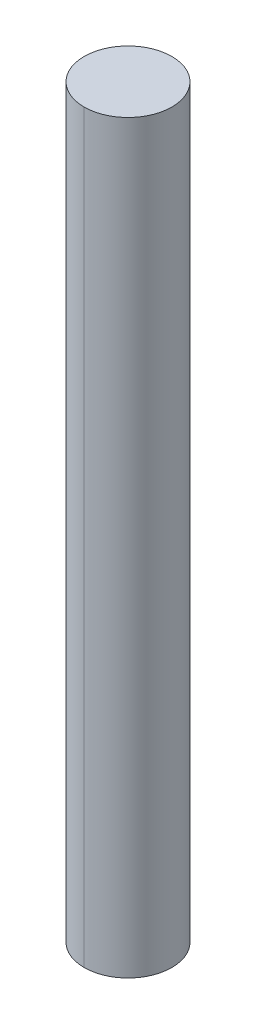
ISO-10303-21;
HEADER;
FILE_DESCRIPTION(('STEP AP214'),'2;1');
FILE_NAME('part.step','',(''),(''),'','','');
FILE_SCHEMA(('AUTOMOTIVE_DESIGN { 1 0 10303 214 1 1 1 1 }'));
ENDSEC;
DATA;
#1=APPLICATION_CONTEXT('core data for automotive mechanical design processes');
#2=APPLICATION_PROTOCOL_DEFINITION('international standard','automotive_design',2000,#1);
#3=PRODUCT_CONTEXT('',#1,'mechanical');
#4=PRODUCT('Part','Part','',(#3));
#5=PRODUCT_RELATED_PRODUCT_CATEGORY('part','',(#4));
#6=PRODUCT_DEFINITION_FORMATION('','',#4);
#7=PRODUCT_DEFINITION_CONTEXT('part definition',#1,'design');
#8=PRODUCT_DEFINITION('design','',#6,#7);
#9=PRODUCT_DEFINITION_SHAPE('','',#8);
#10=(LENGTH_UNIT() NAMED_UNIT(*) SI_UNIT(.MILLI.,.METRE.));
#11=(NAMED_UNIT(*) PLANE_ANGLE_UNIT() SI_UNIT($,.RADIAN.));
#12=(NAMED_UNIT(*) SI_UNIT($,.STERADIAN.) SOLID_ANGLE_UNIT());
#13=UNCERTAINTY_MEASURE_WITH_UNIT(LENGTH_MEASURE(1.E-05),#10,'distance_accuracy_value','');
#14=(GEOMETRIC_REPRESENTATION_CONTEXT(3) GLOBAL_UNCERTAINTY_ASSIGNED_CONTEXT((#13)) GLOBAL_UNIT_ASSIGNED_CONTEXT((#10,
#11,#12)) REPRESENTATION_CONTEXT('',''));
#15=CARTESIAN_POINT('',(0.,0.,0.));
#16=DIRECTION('',(0.,0.,1.));
#17=DIRECTION('',(1.,0.,0.));
#18=AXIS2_PLACEMENT_3D('',#15,#16,#17);
#19=CARTESIAN_POINT('',(0.,0.,0.));
#20=DIRECTION('',(0.,1.,0.));
#21=DIRECTION('',(1.,0.,0.));
#22=AXIS2_PLACEMENT_3D('',#19,#20,#21);
#23=PLANE('',#22);
#24=CARTESIAN_POINT('',(0.,0.,0.));
#25=DIRECTION('',(0.,1.,0.));
#26=DIRECTION('',(0.,0.,1.));
#27=AXIS2_PLACEMENT_3D('',#24,#25,#26);
#28=CIRCLE('',#27,1.5);
#29=CARTESIAN_POINT('',(0.,0.,-1.5));
#30=VERTEX_POINT('',#29);
#31=CARTESIAN_POINT('',(0.,0.,1.5));
#32=VERTEX_POINT('',#31);
#33=EDGE_CURVE('E10',#30,#32,#28,.T.);
#34=ORIENTED_EDGE('',*,*,#33,.F.);
#35=CARTESIAN_POINT('',(0.,0.,0.));
#36=DIRECTION('',(0.,1.,0.));
#37=DIRECTION('',(0.,0.,1.));
#38=AXIS2_PLACEMENT_3D('',#35,#36,#37);
#39=CIRCLE('',#38,1.5);
#40=EDGE_CURVE('E67',#32,#30,#39,.T.);
#41=ORIENTED_EDGE('',*,*,#40,.F.);
#42=EDGE_LOOP('',(#34,#41));
#43=FACE_BOUND('',#42,.T.);
#44=ADVANCED_FACE('F16',(#43),#23,.F.);
#45=CARTESIAN_POINT('',(0.,25.5,0.));
#46=DIRECTION('',(0.,1.,0.));
#47=DIRECTION('',(1.,0.,0.));
#48=AXIS2_PLACEMENT_3D('',#45,#46,#47);
#49=PLANE('',#48);
#50=CARTESIAN_POINT('',(0.,25.5,0.));
#51=DIRECTION('',(0.,1.,0.));
#52=DIRECTION('',(0.,0.,1.));
#53=AXIS2_PLACEMENT_3D('',#50,#51,#52);
#54=CIRCLE('',#53,1.5);
#55=CARTESIAN_POINT('',(0.,25.5,-1.5));
#56=VERTEX_POINT('',#55);
#57=CARTESIAN_POINT('',(0.,25.5,1.5));
#58=VERTEX_POINT('',#57);
#59=EDGE_CURVE('E26',#56,#58,#54,.T.);
#60=ORIENTED_EDGE('',*,*,#59,.T.);
#61=CARTESIAN_POINT('',(0.,25.5,0.));
#62=DIRECTION('',(0.,1.,0.));
#63=DIRECTION('',(0.,0.,1.));
#64=AXIS2_PLACEMENT_3D('',#61,#62,#63);
#65=CIRCLE('',#64,1.5);
#66=EDGE_CURVE('E57',#58,#56,#65,.T.);
#67=ORIENTED_EDGE('',*,*,#66,.T.);
#68=EDGE_LOOP('',(#60,#67));
#69=FACE_BOUND('',#68,.T.);
#70=ADVANCED_FACE('F18',(#69),#49,.T.);
#71=CARTESIAN_POINT('',(0.,25.5,0.));
#72=DIRECTION('',(0.,-1.,0.));
#73=DIRECTION('',(0.,0.,-1.));
#74=AXIS2_PLACEMENT_3D('',#71,#72,#73);
#75=CYLINDRICAL_SURFACE('',#74,1.5);
#76=DIRECTION('',(0.,-1.,0.));
#77=VECTOR('',#76,1.);
#78=CARTESIAN_POINT('',(0.,25.5,1.5));
#79=LINE('',#78,#77);
#80=EDGE_CURVE('E62',#58,#32,#79,.T.);
#81=ORIENTED_EDGE('',*,*,#80,.F.);
#82=ORIENTED_EDGE('',*,*,#59,.F.);
#83=DIRECTION('',(0.,-1.,0.));
#84=VECTOR('',#83,1.);
#85=CARTESIAN_POINT('',(0.,25.5,-1.5));
#86=LINE('',#85,#84);
#87=EDGE_CURVE('E20',#56,#30,#86,.T.);
#88=ORIENTED_EDGE('',*,*,#87,.T.);
#89=ORIENTED_EDGE('',*,*,#33,.T.);
#90=EDGE_LOOP('',(#81,#82,#88,#89));
#91=FACE_BOUND('',#90,.T.);
#92=ADVANCED_FACE('F63',(#91),#75,.T.);
#93=CARTESIAN_POINT('',(0.,25.5,0.));
#94=DIRECTION('',(0.,-1.,0.));
#95=DIRECTION('',(0.,0.,-1.));
#96=AXIS2_PLACEMENT_3D('',#93,#94,#95);
#97=CYLINDRICAL_SURFACE('',#96,1.5);
#98=ORIENTED_EDGE('',*,*,#66,.F.);
#99=ORIENTED_EDGE('',*,*,#80,.T.);
#100=ORIENTED_EDGE('',*,*,#40,.T.);
#101=ORIENTED_EDGE('',*,*,#87,.F.);
#102=EDGE_LOOP('',(#98,#99,#100,#101));
#103=FACE_BOUND('',#102,.T.);
#104=ADVANCED_FACE('F69',(#103),#97,.T.);
#105=CLOSED_SHELL('',(#44,#70,#92,#104));
#106=MANIFOLD_SOLID_BREP('B1',#105);
#107=ADVANCED_BREP_SHAPE_REPRESENTATION('',(#18,#106),#14);
#108=SHAPE_DEFINITION_REPRESENTATION(#9,#107);
ENDSEC;
END-ISO-10303-21;
